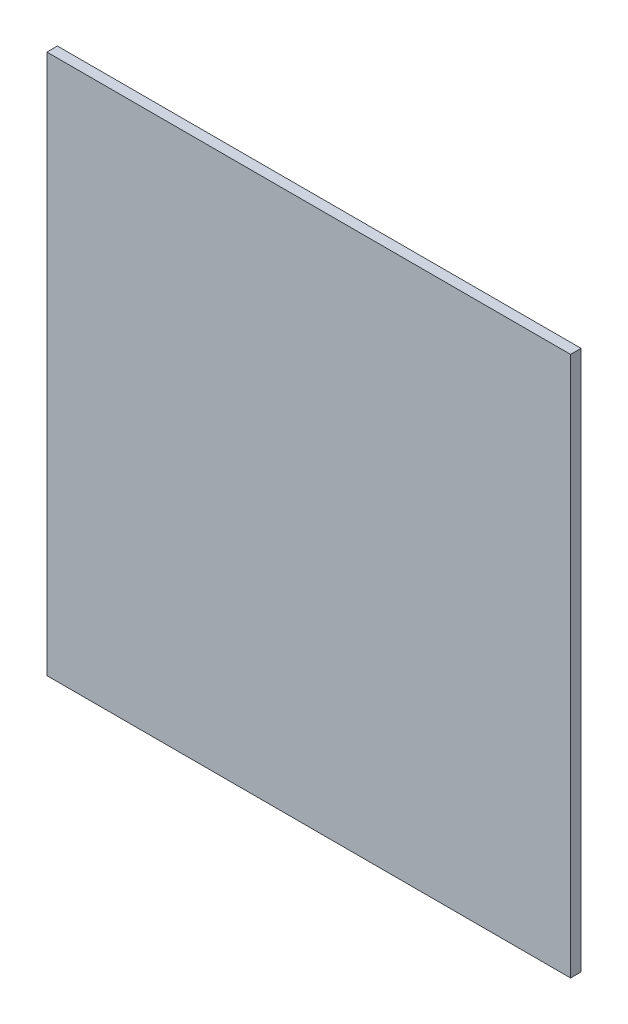
ISO-10303-21;
HEADER;
FILE_DESCRIPTION(('STEP AP214'),'2;1');
FILE_NAME('part.step','',(''),(''),'','','');
FILE_SCHEMA(('AUTOMOTIVE_DESIGN { 1 0 10303 214 1 1 1 1 }'));
ENDSEC;
DATA;
#1=APPLICATION_CONTEXT('core data for automotive mechanical design processes');
#2=APPLICATION_PROTOCOL_DEFINITION('international standard','automotive_design',2000,#1);
#3=PRODUCT_CONTEXT('',#1,'mechanical');
#4=PRODUCT('Part','Part','',(#3));
#5=PRODUCT_RELATED_PRODUCT_CATEGORY('part','',(#4));
#6=PRODUCT_DEFINITION_FORMATION('','',#4);
#7=PRODUCT_DEFINITION_CONTEXT('part definition',#1,'design');
#8=PRODUCT_DEFINITION('design','',#6,#7);
#9=PRODUCT_DEFINITION_SHAPE('','',#8);
#10=(LENGTH_UNIT() NAMED_UNIT(*) SI_UNIT(.MILLI.,.METRE.));
#11=(NAMED_UNIT(*) PLANE_ANGLE_UNIT() SI_UNIT($,.RADIAN.));
#12=(NAMED_UNIT(*) SI_UNIT($,.STERADIAN.) SOLID_ANGLE_UNIT());
#13=UNCERTAINTY_MEASURE_WITH_UNIT(LENGTH_MEASURE(1.E-05),#10,'distance_accuracy_value','');
#14=(GEOMETRIC_REPRESENTATION_CONTEXT(3) GLOBAL_UNCERTAINTY_ASSIGNED_CONTEXT((#13)) GLOBAL_UNIT_ASSIGNED_CONTEXT((#10,
#11,#12)) REPRESENTATION_CONTEXT('',''));
#15=CARTESIAN_POINT('',(0.,0.,0.));
#16=DIRECTION('',(0.,0.,1.));
#17=DIRECTION('',(1.,0.,0.));
#18=AXIS2_PLACEMENT_3D('',#15,#16,#17);
#19=CARTESIAN_POINT('',(0.,0.,5.));
#20=DIRECTION('',(1.,0.,0.));
#21=DIRECTION('',(0.,1.,0.));
#22=AXIS2_PLACEMENT_3D('',#19,#20,#21);
#23=PLANE('',#22);
#24=DIRECTION('',(0.,-1.,0.));
#25=VECTOR('',#24,1.);
#26=CARTESIAN_POINT('',(0.,0.,0.));
#27=LINE('',#26,#25);
#28=CARTESIAN_POINT('',(0.,0.,0.));
#29=VERTEX_POINT('',#28);
#30=CARTESIAN_POINT('',(0.,-257.4,0.));
#31=VERTEX_POINT('',#30);
#32=EDGE_CURVE('E96',#29,#31,#27,.T.);
#33=ORIENTED_EDGE('',*,*,#32,.T.);
#34=DIRECTION('',(0.,0.,-1.));
#35=VECTOR('',#34,1.);
#36=CARTESIAN_POINT('',(0.,-257.4,5.));
#37=LINE('',#36,#35);
#38=CARTESIAN_POINT('',(0.,-257.4,5.));
#39=VERTEX_POINT('',#38);
#40=EDGE_CURVE('E11',#39,#31,#37,.T.);
#41=ORIENTED_EDGE('',*,*,#40,.F.);
#42=DIRECTION('',(0.,-1.,0.));
#43=VECTOR('',#42,1.);
#44=CARTESIAN_POINT('',(0.,0.,5.));
#45=LINE('',#44,#43);
#46=CARTESIAN_POINT('',(0.,0.,5.));
#47=VERTEX_POINT('',#46);
#48=EDGE_CURVE('E84',#47,#39,#45,.T.);
#49=ORIENTED_EDGE('',*,*,#48,.F.);
#50=DIRECTION('',(0.,0.,-1.));
#51=VECTOR('',#50,1.);
#52=CARTESIAN_POINT('',(0.,0.,5.));
#53=LINE('',#52,#51);
#54=EDGE_CURVE('E92',#47,#29,#53,.T.);
#55=ORIENTED_EDGE('',*,*,#54,.T.);
#56=EDGE_LOOP('',(#33,#41,#49,#55));
#57=FACE_BOUND('',#56,.T.);
#58=ADVANCED_FACE('F33',(#57),#23,.F.);
#59=CARTESIAN_POINT('',(0.,-257.4,5.));
#60=DIRECTION('',(0.,1.,0.));
#61=DIRECTION('',(-1.,0.,0.));
#62=AXIS2_PLACEMENT_3D('',#59,#60,#61);
#63=PLANE('',#62);
#64=DIRECTION('',(1.,0.,0.));
#65=VECTOR('',#64,1.);
#66=CARTESIAN_POINT('',(0.,-257.4,0.));
#67=LINE('',#66,#65);
#68=CARTESIAN_POINT('',(249.6,-257.4,0.));
#69=VERTEX_POINT('',#68);
#70=EDGE_CURVE('E88',#31,#69,#67,.T.);
#71=ORIENTED_EDGE('',*,*,#70,.T.);
#72=DIRECTION('',(0.,0.,-1.));
#73=VECTOR('',#72,1.);
#74=CARTESIAN_POINT('',(249.6,-257.4,5.));
#75=LINE('',#74,#73);
#76=CARTESIAN_POINT('',(249.6,-257.4,5.));
#77=VERTEX_POINT('',#76);
#78=EDGE_CURVE('E41',#77,#69,#75,.T.);
#79=ORIENTED_EDGE('',*,*,#78,.F.);
#80=DIRECTION('',(1.,0.,0.));
#81=VECTOR('',#80,1.);
#82=CARTESIAN_POINT('',(0.,-257.4,5.));
#83=LINE('',#82,#81);
#84=EDGE_CURVE('E79',#39,#77,#83,.T.);
#85=ORIENTED_EDGE('',*,*,#84,.F.);
#86=ORIENTED_EDGE('',*,*,#40,.T.);
#87=EDGE_LOOP('',(#71,#79,#85,#86));
#88=FACE_BOUND('',#87,.T.);
#89=ADVANCED_FACE('F87',(#88),#63,.F.);
#90=CARTESIAN_POINT('',(249.6,0.,5.));
#91=DIRECTION('',(-1.,0.,0.));
#92=DIRECTION('',(0.,-1.,0.));
#93=AXIS2_PLACEMENT_3D('',#90,#91,#92);
#94=PLANE('',#93);
#95=DIRECTION('',(0.,1.,0.));
#96=VECTOR('',#95,1.);
#97=CARTESIAN_POINT('',(249.6,0.,0.));
#98=LINE('',#97,#96);
#99=CARTESIAN_POINT('',(249.6,0.,0.));
#100=VERTEX_POINT('',#99);
#101=EDGE_CURVE('E66',#69,#100,#98,.T.);
#102=ORIENTED_EDGE('',*,*,#101,.T.);
#103=DIRECTION('',(0.,0.,-1.));
#104=VECTOR('',#103,1.);
#105=CARTESIAN_POINT('',(249.6,0.,5.));
#106=LINE('',#105,#104);
#107=CARTESIAN_POINT('',(249.6,0.,5.));
#108=VERTEX_POINT('',#107);
#109=EDGE_CURVE('E89',#108,#100,#106,.T.);
#110=ORIENTED_EDGE('',*,*,#109,.F.);
#111=DIRECTION('',(0.,1.,0.));
#112=VECTOR('',#111,1.);
#113=CARTESIAN_POINT('',(249.6,0.,5.));
#114=LINE('',#113,#112);
#115=EDGE_CURVE('E82',#77,#108,#114,.T.);
#116=ORIENTED_EDGE('',*,*,#115,.F.);
#117=ORIENTED_EDGE('',*,*,#78,.T.);
#118=EDGE_LOOP('',(#102,#110,#116,#117));
#119=FACE_BOUND('',#118,.T.);
#120=ADVANCED_FACE('F90',(#119),#94,.F.);
#121=CARTESIAN_POINT('',(0.,0.,5.));
#122=DIRECTION('',(0.,-1.,0.));
#123=DIRECTION('',(0.,0.,-1.));
#124=AXIS2_PLACEMENT_3D('',#121,#122,#123);
#125=PLANE('',#124);
#126=DIRECTION('',(-1.,0.,0.));
#127=VECTOR('',#126,1.);
#128=CARTESIAN_POINT('',(0.,0.,0.));
#129=LINE('',#128,#127);
#130=EDGE_CURVE('E72',#100,#29,#129,.T.);
#131=ORIENTED_EDGE('',*,*,#130,.T.);
#132=ORIENTED_EDGE('',*,*,#54,.F.);
#133=DIRECTION('',(-1.,0.,0.));
#134=VECTOR('',#133,1.);
#135=CARTESIAN_POINT('',(0.,0.,5.));
#136=LINE('',#135,#134);
#137=EDGE_CURVE('E49',#108,#47,#136,.T.);
#138=ORIENTED_EDGE('',*,*,#137,.F.);
#139=ORIENTED_EDGE('',*,*,#109,.T.);
#140=EDGE_LOOP('',(#131,#132,#138,#139));
#141=FACE_BOUND('',#140,.T.);
#142=ADVANCED_FACE('F103',(#141),#125,.F.);
#143=CARTESIAN_POINT('',(0.,0.,5.));
#144=DIRECTION('',(0.,0.,1.));
#145=DIRECTION('',(1.,0.,0.));
#146=AXIS2_PLACEMENT_3D('',#143,#144,#145);
#147=PLANE('',#146);
#148=ORIENTED_EDGE('',*,*,#48,.T.);
#149=ORIENTED_EDGE('',*,*,#84,.T.);
#150=ORIENTED_EDGE('',*,*,#115,.T.);
#151=ORIENTED_EDGE('',*,*,#137,.T.);
#152=EDGE_LOOP('',(#148,#149,#150,#151));
#153=FACE_BOUND('',#152,.T.);
#154=ADVANCED_FACE('F80',(#153),#147,.T.);
#155=CARTESIAN_POINT('',(0.,0.,0.));
#156=DIRECTION('',(0.,0.,1.));
#157=DIRECTION('',(1.,0.,0.));
#158=AXIS2_PLACEMENT_3D('',#155,#156,#157);
#159=PLANE('',#158);
#160=ORIENTED_EDGE('',*,*,#32,.F.);
#161=ORIENTED_EDGE('',*,*,#130,.F.);
#162=ORIENTED_EDGE('',*,*,#101,.F.);
#163=ORIENTED_EDGE('',*,*,#70,.F.);
#164=EDGE_LOOP('',(#160,#161,#162,#163));
#165=FACE_BOUND('',#164,.T.);
#166=ADVANCED_FACE('F106',(#165),#159,.F.);
#167=CLOSED_SHELL('',(#58,#89,#120,#142,#154,#166));
#168=MANIFOLD_SOLID_BREP('B2',#167);
#169=ADVANCED_BREP_SHAPE_REPRESENTATION('',(#18,#168),#14);
#170=SHAPE_DEFINITION_REPRESENTATION(#9,#169);
ENDSEC;
END-ISO-10303-21;
